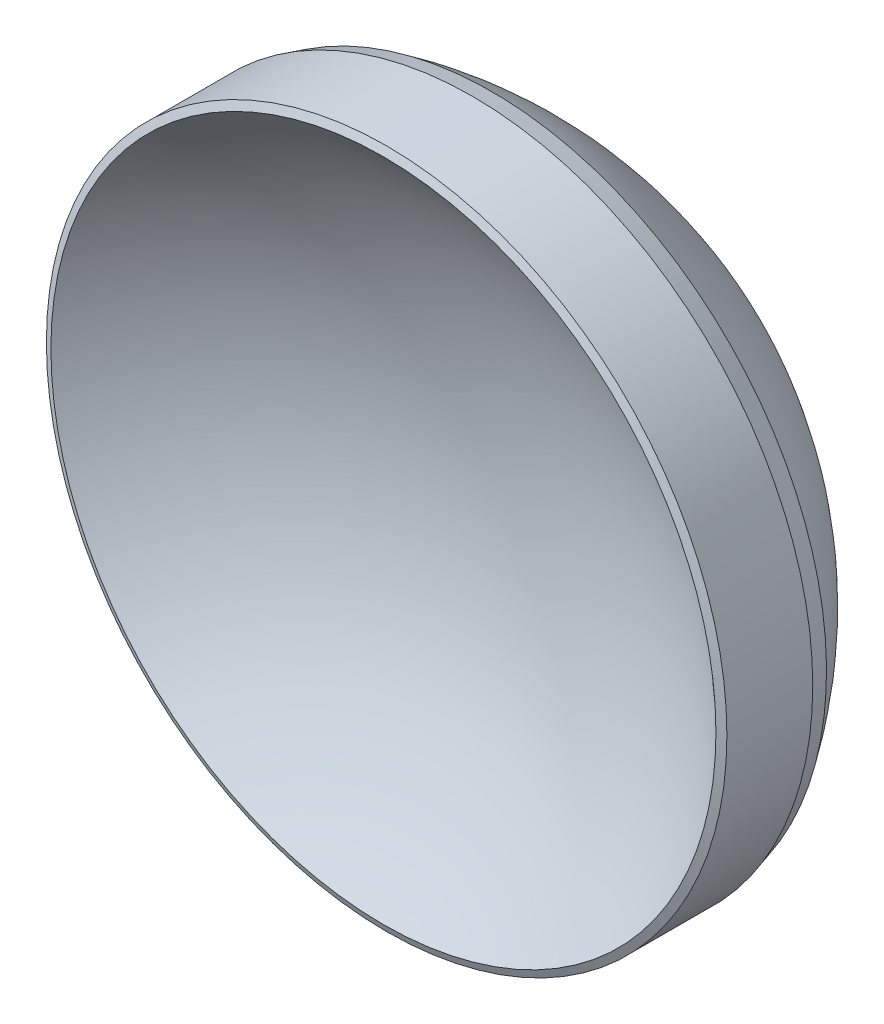
ISO-10303-21;
HEADER;
FILE_DESCRIPTION(('STEP AP214'),'2;1');
FILE_NAME('part.step','',(''),(''),'','','');
FILE_SCHEMA(('AUTOMOTIVE_DESIGN { 1 0 10303 214 1 1 1 1 }'));
ENDSEC;
DATA;
#1=APPLICATION_CONTEXT('core data for automotive mechanical design processes');
#2=APPLICATION_PROTOCOL_DEFINITION('international standard','automotive_design',2000,#1);
#3=PRODUCT_CONTEXT('',#1,'mechanical');
#4=PRODUCT('Part','Part','',(#3));
#5=PRODUCT_RELATED_PRODUCT_CATEGORY('part','',(#4));
#6=PRODUCT_DEFINITION_FORMATION('','',#4);
#7=PRODUCT_DEFINITION_CONTEXT('part definition',#1,'design');
#8=PRODUCT_DEFINITION('design','',#6,#7);
#9=PRODUCT_DEFINITION_SHAPE('','',#8);
#10=(LENGTH_UNIT() NAMED_UNIT(*) SI_UNIT(.MILLI.,.METRE.));
#11=(NAMED_UNIT(*) PLANE_ANGLE_UNIT() SI_UNIT($,.RADIAN.));
#12=(NAMED_UNIT(*) SI_UNIT($,.STERADIAN.) SOLID_ANGLE_UNIT());
#13=UNCERTAINTY_MEASURE_WITH_UNIT(LENGTH_MEASURE(1.E-05),#10,'distance_accuracy_value','');
#14=(GEOMETRIC_REPRESENTATION_CONTEXT(3) GLOBAL_UNCERTAINTY_ASSIGNED_CONTEXT((#13)) GLOBAL_UNIT_ASSIGNED_CONTEXT((#10,
#11,#12)) REPRESENTATION_CONTEXT('',''));
#15=CARTESIAN_POINT('',(0.,0.,0.));
#16=DIRECTION('',(0.,0.,1.));
#17=DIRECTION('',(1.,0.,0.));
#18=AXIS2_PLACEMENT_3D('',#15,#16,#17);
#19=CARTESIAN_POINT('',(0.,0.,10.476));
#20=DIRECTION('',(0.,0.,1.));
#21=DIRECTION('',(0.,1.,0.));
#22=AXIS2_PLACEMENT_3D('',#19,#20,#21);
#23=SPHERICAL_SURFACE('',#22,9.02600000000001);
#24=CARTESIAN_POINT('',(0.,0.,3.92170001281117));
#25=DIRECTION('',(0.,0.,1.));
#26=DIRECTION('',(0.,-1.,0.));
#27=AXIS2_PLACEMENT_3D('',#24,#25,#26);
#28=CIRCLE('',#27,6.20562870931999);
#29=CARTESIAN_POINT('',(0.,-6.20562870931999,3.92170001281117));
#30=VERTEX_POINT('',#29);
#31=EDGE_CURVE('E8',#30,#30,#28,.T.);
#32=ORIENTED_EDGE('',*,*,#31,.T.);
#33=EDGE_LOOP('',(#32));
#34=FACE_BOUND('',#33,.T.);
#35=ADVANCED_FACE('F12',(#34),#23,.F.);
#36=CARTESIAN_POINT('',(0.,0.,6.05));
#37=DIRECTION('',(0.,0.,1.));
#38=DIRECTION('',(0.,-1.,0.));
#39=AXIS2_PLACEMENT_3D('',#36,#37,#38);
#40=SPHERICAL_SURFACE('',#39,7.5);
#41=CARTESIAN_POINT('',(0.,0.,1.89822641725588));
#42=DIRECTION('',(0.,0.,1.));
#43=DIRECTION('',(0.,-1.,0.));
#44=AXIS2_PLACEMENT_3D('',#41,#42,#43);
#45=CIRCLE('',#44,6.24602082270209);
#46=CARTESIAN_POINT('',(0.,-6.24602082270209,1.89822641725588));
#47=VERTEX_POINT('',#46);
#48=EDGE_CURVE('E19',#47,#47,#45,.F.);
#49=ORIENTED_EDGE('',*,*,#48,.T.);
#50=EDGE_LOOP('',(#49));
#51=FACE_BOUND('',#50,.T.);
#52=ADVANCED_FACE('F44',(#51),#40,.T.);
#53=CARTESIAN_POINT('',(0.,0.,1.45));
#54=DIRECTION('',(0.,0.,1.));
#55=DIRECTION('',(0.,-1.,0.));
#56=AXIS2_PLACEMENT_3D('',#53,#54,#55);
#57=CYLINDRICAL_SURFACE('',#56,6.35);
#58=CARTESIAN_POINT('',(0.,0.,2.25907278943852));
#59=DIRECTION('',(0.,0.,1.));
#60=DIRECTION('',(0.,-1.,0.));
#61=AXIS2_PLACEMENT_3D('',#58,#59,#60);
#62=CIRCLE('',#61,6.35);
#63=CARTESIAN_POINT('',(0.,-6.35,2.25907278943852));
#64=VERTEX_POINT('',#63);
#65=EDGE_CURVE('E23',#64,#64,#62,.T.);
#66=ORIENTED_EDGE('',*,*,#65,.T.);
#67=EDGE_LOOP('',(#66));
#68=FACE_BOUND('',#67,.T.);
#69=CARTESIAN_POINT('',(0.,0.,3.86147149043673));
#70=DIRECTION('',(0.,0.,-1.));
#71=DIRECTION('',(0.,1.,0.));
#72=AXIS2_PLACEMENT_3D('',#69,#70,#71);
#73=CIRCLE('',#72,6.35);
#74=CARTESIAN_POINT('',(0.,6.35,3.86147149043673));
#75=VERTEX_POINT('',#74);
#76=EDGE_CURVE('E27',#75,#75,#73,.T.);
#77=ORIENTED_EDGE('',*,*,#76,.T.);
#78=EDGE_LOOP('',(#77));
#79=FACE_BOUND('',#78,.T.);
#80=ADVANCED_FACE('F33',(#68,#79),#57,.T.);
#81=CARTESIAN_POINT('',(0.,0.,2.25907278943852));
#82=DIRECTION('',(0.,0.,1.));
#83=DIRECTION('',(0.,-1.,0.));
#84=AXIS2_PLACEMENT_3D('',#81,#82,#83);
#85=CONICAL_SURFACE('',#84,6.35,0.280553408115199);
#86=ORIENTED_EDGE('',*,*,#48,.F.);
#87=EDGE_LOOP('',(#86));
#88=FACE_BOUND('',#87,.T.);
#89=ORIENTED_EDGE('',*,*,#65,.F.);
#90=EDGE_LOOP('',(#89));
#91=FACE_BOUND('',#90,.T.);
#92=ADVANCED_FACE('F37',(#88,#91),#85,.T.);
#93=CARTESIAN_POINT('',(0.,0.,3.92170001281117));
#94=DIRECTION('',(0.,0.,-1.));
#95=DIRECTION('',(0.,1.,0.));
#96=AXIS2_PLACEMENT_3D('',#93,#94,#95);
#97=CONICAL_SURFACE('',#96,6.20562870931999,1.17556961707508);
#98=ORIENTED_EDGE('',*,*,#76,.F.);
#99=EDGE_LOOP('',(#98));
#100=FACE_BOUND('',#99,.T.);
#101=ORIENTED_EDGE('',*,*,#31,.F.);
#102=EDGE_LOOP('',(#101));
#103=FACE_BOUND('',#102,.T.);
#104=ADVANCED_FACE('F14',(#100,#103),#97,.T.);
#105=CLOSED_SHELL('',(#35,#52,#80,#92,#104));
#106=MANIFOLD_SOLID_BREP('B1',#105);
#107=ADVANCED_BREP_SHAPE_REPRESENTATION('',(#18,#106),#14);
#108=SHAPE_DEFINITION_REPRESENTATION(#9,#107);
ENDSEC;
END-ISO-10303-21;
